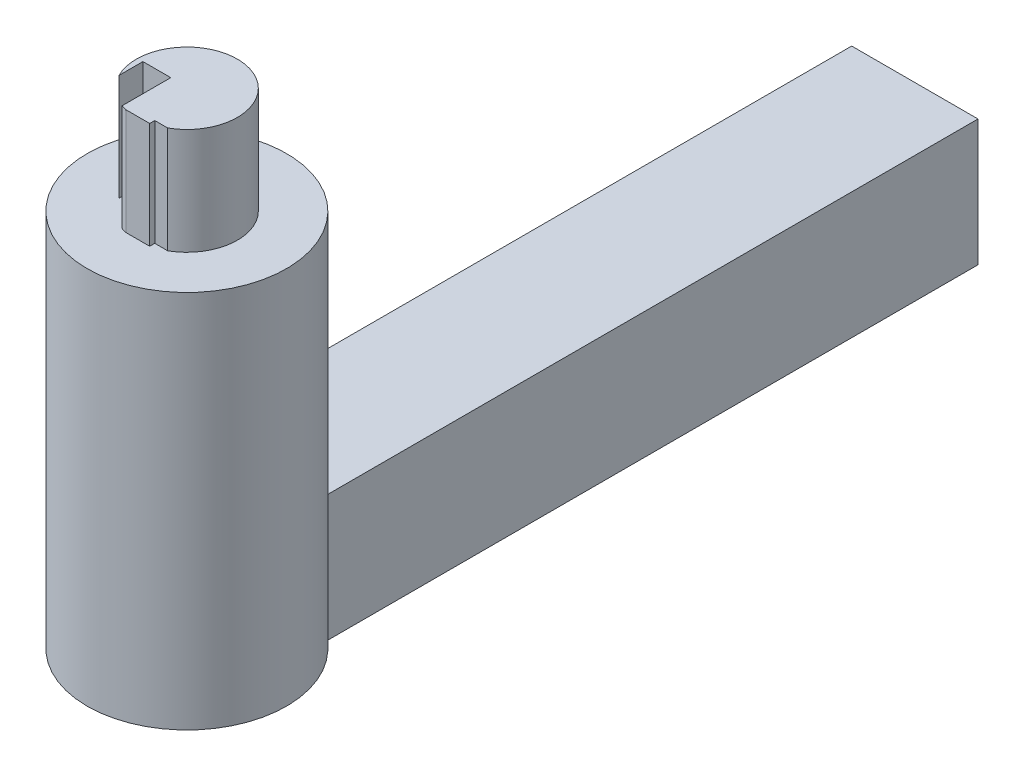
ISO-10303-21;
HEADER;
FILE_DESCRIPTION(('STEP AP214'),'2;1');
FILE_NAME('part.step','',(''),(''),'','','');
FILE_SCHEMA(('AUTOMOTIVE_DESIGN { 1 0 10303 214 1 1 1 1 }'));
ENDSEC;
DATA;
#1=APPLICATION_CONTEXT('core data for automotive mechanical design processes');
#2=APPLICATION_PROTOCOL_DEFINITION('international standard','automotive_design',2000,#1);
#3=PRODUCT_CONTEXT('',#1,'mechanical');
#4=PRODUCT('Part','Part','',(#3));
#5=PRODUCT_RELATED_PRODUCT_CATEGORY('part','',(#4));
#6=PRODUCT_DEFINITION_FORMATION('','',#4);
#7=PRODUCT_DEFINITION_CONTEXT('part definition',#1,'design');
#8=PRODUCT_DEFINITION('design','',#6,#7);
#9=PRODUCT_DEFINITION_SHAPE('','',#8);
#10=(LENGTH_UNIT() NAMED_UNIT(*) SI_UNIT(.MILLI.,.METRE.));
#11=(NAMED_UNIT(*) PLANE_ANGLE_UNIT() SI_UNIT($,.RADIAN.));
#12=(NAMED_UNIT(*) SI_UNIT($,.STERADIAN.) SOLID_ANGLE_UNIT());
#13=UNCERTAINTY_MEASURE_WITH_UNIT(LENGTH_MEASURE(1.E-05),#10,'distance_accuracy_value','');
#14=(GEOMETRIC_REPRESENTATION_CONTEXT(3) GLOBAL_UNCERTAINTY_ASSIGNED_CONTEXT((#13)) GLOBAL_UNIT_ASSIGNED_CONTEXT((#10,
#11,#12)) REPRESENTATION_CONTEXT('',''));
#15=CARTESIAN_POINT('',(0.,0.,0.));
#16=DIRECTION('',(0.,0.,1.));
#17=DIRECTION('',(1.,0.,0.));
#18=AXIS2_PLACEMENT_3D('',#15,#16,#17);
#19=CARTESIAN_POINT('',(4.75,9.5,-27.375));
#20=DIRECTION('',(-1.,0.,0.));
#21=DIRECTION('',(0.,0.,1.));
#22=AXIS2_PLACEMENT_3D('',#19,#20,#21);
#23=PLANE('',#22);
#24=DIRECTION('',(0.,0.,-1.));
#25=VECTOR('',#24,1.);
#26=CARTESIAN_POINT('',(4.75,9.5,-27.375));
#27=LINE('',#26,#25);
#28=CARTESIAN_POINT('',(4.75,9.5,21.5709066168781));
#29=VERTEX_POINT('',#28);
#30=CARTESIAN_POINT('',(4.75,9.5,-27.375));
#31=VERTEX_POINT('',#30);
#32=EDGE_CURVE('E179',#29,#31,#27,.T.);
#33=ORIENTED_EDGE('',*,*,#32,.F.);
#34=DIRECTION('',(0.,1.,0.));
#35=VECTOR('',#34,1.);
#36=CARTESIAN_POINT('',(4.75,-21.2132034355964,21.5709066168781));
#37=LINE('',#36,#35);
#38=CARTESIAN_POINT('',(4.75,0.,21.5709066168781));
#39=VERTEX_POINT('',#38);
#40=EDGE_CURVE('E175',#29,#39,#37,.F.);
#41=ORIENTED_EDGE('',*,*,#40,.T.);
#42=DIRECTION('',(0.,0.,-1.));
#43=VECTOR('',#42,1.);
#44=CARTESIAN_POINT('',(4.75,0.,-27.375));
#45=LINE('',#44,#43);
#46=CARTESIAN_POINT('',(4.75,0.,-27.375));
#47=VERTEX_POINT('',#46);
#48=EDGE_CURVE('E178',#39,#47,#45,.T.);
#49=ORIENTED_EDGE('',*,*,#48,.T.);
#50=DIRECTION('',(0.,-1.,0.));
#51=VECTOR('',#50,1.);
#52=CARTESIAN_POINT('',(4.75,9.5,-27.375));
#53=LINE('',#52,#51);
#54=EDGE_CURVE('E11',#31,#47,#53,.T.);
#55=ORIENTED_EDGE('',*,*,#54,.F.);
#56=EDGE_LOOP('',(#33,#41,#49,#55));
#57=FACE_BOUND('',#56,.T.);
#58=ADVANCED_FACE('F41',(#57),#23,.F.);
#59=CARTESIAN_POINT('',(-4.75,9.5,-27.375));
#60=DIRECTION('',(0.,0.,1.));
#61=DIRECTION('',(1.,0.,0.));
#62=AXIS2_PLACEMENT_3D('',#59,#60,#61);
#63=PLANE('',#62);
#64=DIRECTION('',(-1.,0.,0.));
#65=VECTOR('',#64,1.);
#66=CARTESIAN_POINT('',(-4.75,0.,-27.375));
#67=LINE('',#66,#65);
#68=CARTESIAN_POINT('',(-4.75,0.,-27.375));
#69=VERTEX_POINT('',#68);
#70=EDGE_CURVE('E191',#47,#69,#67,.T.);
#71=ORIENTED_EDGE('',*,*,#70,.T.);
#72=DIRECTION('',(0.,-1.,0.));
#73=VECTOR('',#72,1.);
#74=CARTESIAN_POINT('',(-4.75,9.5,-27.375));
#75=LINE('',#74,#73);
#76=CARTESIAN_POINT('',(-4.75,9.5,-27.375));
#77=VERTEX_POINT('',#76);
#78=EDGE_CURVE('E49',#77,#69,#75,.T.);
#79=ORIENTED_EDGE('',*,*,#78,.F.);
#80=DIRECTION('',(-1.,0.,0.));
#81=VECTOR('',#80,1.);
#82=CARTESIAN_POINT('',(-4.75,9.5,-27.375));
#83=LINE('',#82,#81);
#84=EDGE_CURVE('E182',#31,#77,#83,.T.);
#85=ORIENTED_EDGE('',*,*,#84,.F.);
#86=ORIENTED_EDGE('',*,*,#54,.T.);
#87=EDGE_LOOP('',(#71,#79,#85,#86));
#88=FACE_BOUND('',#87,.T.);
#89=ADVANCED_FACE('F218',(#88),#63,.F.);
#90=CARTESIAN_POINT('',(-4.75,9.5,-27.375));
#91=DIRECTION('',(1.,0.,0.));
#92=DIRECTION('',(0.,0.,-1.));
#93=AXIS2_PLACEMENT_3D('',#90,#91,#92);
#94=PLANE('',#93);
#95=DIRECTION('',(0.,0.,1.));
#96=VECTOR('',#95,1.);
#97=CARTESIAN_POINT('',(-4.75,0.,-27.375));
#98=LINE('',#97,#96);
#99=CARTESIAN_POINT('',(-4.75,0.,21.5709066168781));
#100=VERTEX_POINT('',#99);
#101=EDGE_CURVE('E183',#69,#100,#98,.T.);
#102=ORIENTED_EDGE('',*,*,#101,.T.);
#103=DIRECTION('',(0.,1.,0.));
#104=VECTOR('',#103,1.);
#105=CARTESIAN_POINT('',(-4.75,-21.2132034355964,21.5709066168781));
#106=LINE('',#105,#104);
#107=CARTESIAN_POINT('',(-4.75,9.5,21.5709066168781));
#108=VERTEX_POINT('',#107);
#109=EDGE_CURVE('E171',#100,#108,#106,.T.);
#110=ORIENTED_EDGE('',*,*,#109,.T.);
#111=DIRECTION('',(0.,0.,1.));
#112=VECTOR('',#111,1.);
#113=CARTESIAN_POINT('',(-4.75,9.5,-27.375));
#114=LINE('',#113,#112);
#115=EDGE_CURVE('E186',#77,#108,#114,.T.);
#116=ORIENTED_EDGE('',*,*,#115,.F.);
#117=ORIENTED_EDGE('',*,*,#78,.T.);
#118=EDGE_LOOP('',(#102,#110,#116,#117));
#119=FACE_BOUND('',#118,.T.);
#120=ADVANCED_FACE('F201',(#119),#94,.F.);
#121=CARTESIAN_POINT('',(0.,9.5,0.));
#122=DIRECTION('',(0.,1.,0.));
#123=DIRECTION('',(0.,0.,1.));
#124=AXIS2_PLACEMENT_3D('',#121,#122,#123);
#125=PLANE('',#124);
#126=CARTESIAN_POINT('',(0.,9.5,27.375));
#127=DIRECTION('',(0.,1.,0.));
#128=DIRECTION('',(0.,0.,1.));
#129=AXIS2_PLACEMENT_3D('',#126,#127,#128);
#130=CIRCLE('',#129,7.5);
#131=EDGE_CURVE('E167',#29,#108,#130,.T.);
#132=ORIENTED_EDGE('',*,*,#131,.F.);
#133=ORIENTED_EDGE('',*,*,#32,.T.);
#134=ORIENTED_EDGE('',*,*,#84,.T.);
#135=ORIENTED_EDGE('',*,*,#115,.T.);
#136=EDGE_LOOP('',(#132,#133,#134,#135));
#137=FACE_BOUND('',#136,.T.);
#138=ADVANCED_FACE('F215',(#137),#125,.T.);
#139=CARTESIAN_POINT('',(0.,0.,0.));
#140=DIRECTION('',(0.,1.,0.));
#141=DIRECTION('',(0.,0.,1.));
#142=AXIS2_PLACEMENT_3D('',#139,#140,#141);
#143=PLANE('',#142);
#144=ORIENTED_EDGE('',*,*,#48,.F.);
#145=CARTESIAN_POINT('',(0.,0.,27.375));
#146=DIRECTION('',(0.,1.,0.));
#147=DIRECTION('',(0.,0.,1.));
#148=AXIS2_PLACEMENT_3D('',#145,#146,#147);
#149=CIRCLE('',#148,7.5);
#150=EDGE_CURVE('E158',#39,#100,#149,.F.);
#151=ORIENTED_EDGE('',*,*,#150,.T.);
#152=ORIENTED_EDGE('',*,*,#101,.F.);
#153=ORIENTED_EDGE('',*,*,#70,.F.);
#154=EDGE_LOOP('',(#144,#151,#152,#153));
#155=FACE_BOUND('',#154,.T.);
#156=ADVANCED_FACE('F208',(#155),#143,.F.);
#157=CARTESIAN_POINT('',(0.,-21.2132034355964,27.375));
#158=DIRECTION('',(0.,1.,0.));
#159=DIRECTION('',(0.,0.,1.));
#160=AXIS2_PLACEMENT_3D('',#157,#158,#159);
#161=CYLINDRICAL_SURFACE('',#160,7.5);
#162=CARTESIAN_POINT('',(0.,28.5,27.375));
#163=DIRECTION('',(0.,1.,0.));
#164=DIRECTION('',(0.,0.,1.));
#165=AXIS2_PLACEMENT_3D('',#162,#163,#164);
#166=CIRCLE('',#165,7.5);
#167=CARTESIAN_POINT('',(0.,28.5,34.875));
#168=VERTEX_POINT('',#167);
#169=EDGE_CURVE('E153',#168,#168,#166,.T.);
#170=ORIENTED_EDGE('',*,*,#169,.F.);
#171=EDGE_LOOP('',(#170));
#172=FACE_BOUND('',#171,.T.);
#173=ORIENTED_EDGE('',*,*,#40,.F.);
#174=ORIENTED_EDGE('',*,*,#131,.T.);
#175=ORIENTED_EDGE('',*,*,#109,.F.);
#176=ORIENTED_EDGE('',*,*,#150,.F.);
#177=EDGE_LOOP('',(#173,#174,#175,#176));
#178=FACE_BOUND('',#177,.T.);
#179=ADVANCED_FACE('F212',(#172,#178),#161,.T.);
#180=CARTESIAN_POINT('',(0.,28.5,27.375));
#181=DIRECTION('',(0.,1.,0.));
#182=DIRECTION('',(0.,0.,1.));
#183=AXIS2_PLACEMENT_3D('',#180,#181,#182);
#184=PLANE('',#183);
#185=CARTESIAN_POINT('',(0.,28.5,27.375));
#186=DIRECTION('',(0.,1.,0.));
#187=DIRECTION('',(0.,0.,1.));
#188=AXIS2_PLACEMENT_3D('',#185,#186,#187);
#189=CIRCLE('',#188,3.8);
#190=CARTESIAN_POINT('',(-1.29624150996569,28.5,30.94708033894));
#191=VERTEX_POINT('',#190);
#192=CARTESIAN_POINT('',(-0.905889425871463,28.5,31.0654422970823));
#193=VERTEX_POINT('',#192);
#194=EDGE_CURVE('E56',#191,#193,#189,.T.);
#195=ORIENTED_EDGE('',*,*,#194,.F.);
#196=DIRECTION('',(0.,0.,1.));
#197=VECTOR('',#196,1.);
#198=CARTESIAN_POINT('',(-1.29624150996569,28.5,30.94708033894));
#199=LINE('',#198,#197);
#200=CARTESIAN_POINT('',(-1.29624150996569,28.5,27.2894334293422));
#201=VERTEX_POINT('',#200);
#202=EDGE_CURVE('E60',#201,#191,#199,.T.);
#203=ORIENTED_EDGE('',*,*,#202,.F.);
#204=DIRECTION('',(1.,0.,0.));
#205=VECTOR('',#204,1.);
#206=CARTESIAN_POINT('',(-1.29624150996569,28.5,27.2894334293422));
#207=LINE('',#206,#205);
#208=CARTESIAN_POINT('',(-3.391270855646,28.5,27.2894334293422));
#209=VERTEX_POINT('',#208);
#210=EDGE_CURVE('E369',#209,#201,#207,.T.);
#211=ORIENTED_EDGE('',*,*,#210,.F.);
#212=DIRECTION('',(0.,0.,-1.));
#213=VECTOR('',#212,1.);
#214=CARTESIAN_POINT('',(-3.391270855646,28.5,29.0894334293422));
#215=LINE('',#214,#213);
#216=CARTESIAN_POINT('',(-3.391270855646,28.5,29.0894334293422));
#217=VERTEX_POINT('',#216);
#218=EDGE_CURVE('E414',#217,#209,#215,.T.);
#219=ORIENTED_EDGE('',*,*,#218,.F.);
#220=CARTESIAN_POINT('',(0.,28.5,27.375));
#221=DIRECTION('',(0.,1.,0.));
#222=DIRECTION('',(0.,0.,1.));
#223=AXIS2_PLACEMENT_3D('',#220,#221,#222);
#224=CIRCLE('',#223,3.8);
#225=CARTESIAN_POINT('',(1.86802767047801,28.5,30.6841498337683));
#226=VERTEX_POINT('',#225);
#227=EDGE_CURVE('E406',#226,#217,#224,.T.);
#228=ORIENTED_EDGE('',*,*,#227,.F.);
#229=DIRECTION('',(1.,0.,0.));
#230=VECTOR('',#229,1.);
#231=CARTESIAN_POINT('',(1.86802767047801,28.5,30.6841498337683));
#232=LINE('',#231,#230);
#233=CARTESIAN_POINT('',(0.894110574128536,28.5,30.6841498337683));
#234=VERTEX_POINT('',#233);
#235=EDGE_CURVE('E397',#234,#226,#232,.T.);
#236=ORIENTED_EDGE('',*,*,#235,.F.);
#237=DIRECTION('',(0.,0.,-1.));
#238=VECTOR('',#237,1.);
#239=CARTESIAN_POINT('',(0.894110574128536,28.5,30.6841498337683));
#240=LINE('',#239,#238);
#241=CARTESIAN_POINT('',(0.894110574128536,28.5,31.0654422970823));
#242=VERTEX_POINT('',#241);
#243=EDGE_CURVE('E400',#242,#234,#240,.T.);
#244=ORIENTED_EDGE('',*,*,#243,.F.);
#245=DIRECTION('',(1.,0.,0.));
#246=VECTOR('',#245,1.);
#247=CARTESIAN_POINT('',(-0.905889425871463,28.5,31.0654422970823));
#248=LINE('',#247,#246);
#249=EDGE_CURVE('E402',#193,#242,#248,.T.);
#250=ORIENTED_EDGE('',*,*,#249,.F.);
#251=EDGE_LOOP('',(#195,#203,#211,#219,#228,#236,#244,#250));
#252=FACE_BOUND('',#251,.T.);
#253=ORIENTED_EDGE('',*,*,#169,.T.);
#254=EDGE_LOOP('',(#253));
#255=FACE_BOUND('',#254,.T.);
#256=ADVANCED_FACE('F232',(#252,#255),#184,.T.);
#257=CARTESIAN_POINT('',(0.,36.5,27.375));
#258=DIRECTION('',(0.,-1.,0.));
#259=DIRECTION('',(0.,0.,-1.));
#260=AXIS2_PLACEMENT_3D('',#257,#258,#259);
#261=CYLINDRICAL_SURFACE('',#260,3.8);
#262=ORIENTED_EDGE('',*,*,#194,.T.);
#263=DIRECTION('',(0.,-1.,0.));
#264=VECTOR('',#263,1.);
#265=CARTESIAN_POINT('',(-0.905889425871463,36.5,31.0654422970823));
#266=LINE('',#265,#264);
#267=CARTESIAN_POINT('',(-0.905889425871463,36.5,31.0654422970823));
#268=VERTEX_POINT('',#267);
#269=EDGE_CURVE('E133',#268,#193,#266,.T.);
#270=ORIENTED_EDGE('',*,*,#269,.F.);
#271=CARTESIAN_POINT('',(0.,36.5,27.375));
#272=DIRECTION('',(0.,1.,0.));
#273=DIRECTION('',(0.,0.,1.));
#274=AXIS2_PLACEMENT_3D('',#271,#272,#273);
#275=CIRCLE('',#274,3.8);
#276=CARTESIAN_POINT('',(-1.29624150996569,36.5,30.94708033894));
#277=VERTEX_POINT('',#276);
#278=EDGE_CURVE('E140',#277,#268,#275,.T.);
#279=ORIENTED_EDGE('',*,*,#278,.F.);
#280=DIRECTION('',(0.,-1.,0.));
#281=VECTOR('',#280,1.);
#282=CARTESIAN_POINT('',(-1.29624150996569,36.5,30.94708033894));
#283=LINE('',#282,#281);
#284=EDGE_CURVE('E365',#277,#191,#283,.T.);
#285=ORIENTED_EDGE('',*,*,#284,.T.);
#286=EDGE_LOOP('',(#262,#270,#279,#285));
#287=FACE_BOUND('',#286,.T.);
#288=ADVANCED_FACE('F151',(#287),#261,.T.);
#289=CARTESIAN_POINT('',(-0.905889425871463,36.5,31.0654422970823));
#290=DIRECTION('',(0.,0.,-1.));
#291=DIRECTION('',(-1.,0.,0.));
#292=AXIS2_PLACEMENT_3D('',#289,#290,#291);
#293=PLANE('',#292);
#294=ORIENTED_EDGE('',*,*,#249,.T.);
#295=DIRECTION('',(0.,-1.,0.));
#296=VECTOR('',#295,1.);
#297=CARTESIAN_POINT('',(0.894110574128536,36.5,31.0654422970823));
#298=LINE('',#297,#296);
#299=CARTESIAN_POINT('',(0.894110574128536,36.5,31.0654422970823));
#300=VERTEX_POINT('',#299);
#301=EDGE_CURVE('E135',#300,#242,#298,.T.);
#302=ORIENTED_EDGE('',*,*,#301,.F.);
#303=DIRECTION('',(1.,0.,0.));
#304=VECTOR('',#303,1.);
#305=CARTESIAN_POINT('',(-0.905889425871463,36.5,31.0654422970823));
#306=LINE('',#305,#304);
#307=EDGE_CURVE('E128',#268,#300,#306,.T.);
#308=ORIENTED_EDGE('',*,*,#307,.F.);
#309=ORIENTED_EDGE('',*,*,#269,.T.);
#310=EDGE_LOOP('',(#294,#302,#308,#309));
#311=FACE_BOUND('',#310,.T.);
#312=ADVANCED_FACE('F131',(#311),#293,.F.);
#313=CARTESIAN_POINT('',(0.894110574128536,36.5,30.6841498337683));
#314=DIRECTION('',(-1.,0.,0.));
#315=DIRECTION('',(0.,0.,1.));
#316=AXIS2_PLACEMENT_3D('',#313,#314,#315);
#317=PLANE('',#316);
#318=ORIENTED_EDGE('',*,*,#243,.T.);
#319=DIRECTION('',(0.,-1.,0.));
#320=VECTOR('',#319,1.);
#321=CARTESIAN_POINT('',(0.894110574128536,36.5,30.6841498337683));
#322=LINE('',#321,#320);
#323=CARTESIAN_POINT('',(0.894110574128536,36.5,30.6841498337683));
#324=VERTEX_POINT('',#323);
#325=EDGE_CURVE('E160',#324,#234,#322,.T.);
#326=ORIENTED_EDGE('',*,*,#325,.F.);
#327=DIRECTION('',(0.,0.,-1.));
#328=VECTOR('',#327,1.);
#329=CARTESIAN_POINT('',(0.894110574128536,36.5,30.6841498337683));
#330=LINE('',#329,#328);
#331=EDGE_CURVE('E139',#300,#324,#330,.T.);
#332=ORIENTED_EDGE('',*,*,#331,.F.);
#333=ORIENTED_EDGE('',*,*,#301,.T.);
#334=EDGE_LOOP('',(#318,#326,#332,#333));
#335=FACE_BOUND('',#334,.T.);
#336=ADVANCED_FACE('F240',(#335),#317,.F.);
#337=CARTESIAN_POINT('',(1.86802767047801,36.5,30.6841498337683));
#338=DIRECTION('',(0.,0.,-1.));
#339=DIRECTION('',(-1.,0.,0.));
#340=AXIS2_PLACEMENT_3D('',#337,#338,#339);
#341=PLANE('',#340);
#342=ORIENTED_EDGE('',*,*,#235,.T.);
#343=DIRECTION('',(0.,-1.,0.));
#344=VECTOR('',#343,1.);
#345=CARTESIAN_POINT('',(1.86802767047801,36.5,30.6841498337683));
#346=LINE('',#345,#344);
#347=CARTESIAN_POINT('',(1.86802767047801,36.5,30.6841498337683));
#348=VERTEX_POINT('',#347);
#349=EDGE_CURVE('E388',#348,#226,#346,.T.);
#350=ORIENTED_EDGE('',*,*,#349,.F.);
#351=DIRECTION('',(1.,0.,0.));
#352=VECTOR('',#351,1.);
#353=CARTESIAN_POINT('',(1.86802767047801,36.5,30.6841498337683));
#354=LINE('',#353,#352);
#355=EDGE_CURVE('E398',#324,#348,#354,.T.);
#356=ORIENTED_EDGE('',*,*,#355,.F.);
#357=ORIENTED_EDGE('',*,*,#325,.T.);
#358=EDGE_LOOP('',(#342,#350,#356,#357));
#359=FACE_BOUND('',#358,.T.);
#360=ADVANCED_FACE('F243',(#359),#341,.F.);
#361=CARTESIAN_POINT('',(0.,36.5,27.375));
#362=DIRECTION('',(0.,-1.,0.));
#363=DIRECTION('',(0.,0.,-1.));
#364=AXIS2_PLACEMENT_3D('',#361,#362,#363);
#365=CYLINDRICAL_SURFACE('',#364,3.8);
#366=ORIENTED_EDGE('',*,*,#227,.T.);
#367=DIRECTION('',(0.,-1.,0.));
#368=VECTOR('',#367,1.);
#369=CARTESIAN_POINT('',(-3.391270855646,36.5,29.0894334293422));
#370=LINE('',#369,#368);
#371=CARTESIAN_POINT('',(-3.391270855646,36.5,29.0894334293422));
#372=VERTEX_POINT('',#371);
#373=EDGE_CURVE('E384',#372,#217,#370,.T.);
#374=ORIENTED_EDGE('',*,*,#373,.F.);
#375=CARTESIAN_POINT('',(0.,36.5,27.375));
#376=DIRECTION('',(0.,1.,0.));
#377=DIRECTION('',(0.,0.,1.));
#378=AXIS2_PLACEMENT_3D('',#375,#376,#377);
#379=CIRCLE('',#378,3.8);
#380=EDGE_CURVE('E425',#348,#372,#379,.T.);
#381=ORIENTED_EDGE('',*,*,#380,.F.);
#382=ORIENTED_EDGE('',*,*,#349,.T.);
#383=EDGE_LOOP('',(#366,#374,#381,#382));
#384=FACE_BOUND('',#383,.T.);
#385=ADVANCED_FACE('F247',(#384),#365,.T.);
#386=CARTESIAN_POINT('',(-3.391270855646,36.5,29.0894334293422));
#387=DIRECTION('',(-1.,0.,0.));
#388=DIRECTION('',(0.,0.,1.));
#389=AXIS2_PLACEMENT_3D('',#386,#387,#388);
#390=PLANE('',#389);
#391=ORIENTED_EDGE('',*,*,#218,.T.);
#392=DIRECTION('',(0.,-1.,0.));
#393=VECTOR('',#392,1.);
#394=CARTESIAN_POINT('',(-3.391270855646,36.5,27.2894334293422));
#395=LINE('',#394,#393);
#396=CARTESIAN_POINT('',(-3.391270855646,36.5,27.2894334293422));
#397=VERTEX_POINT('',#396);
#398=EDGE_CURVE('E375',#397,#209,#395,.T.);
#399=ORIENTED_EDGE('',*,*,#398,.F.);
#400=DIRECTION('',(0.,0.,-1.));
#401=VECTOR('',#400,1.);
#402=CARTESIAN_POINT('',(-3.391270855646,36.5,29.0894334293422));
#403=LINE('',#402,#401);
#404=EDGE_CURVE('E423',#372,#397,#403,.T.);
#405=ORIENTED_EDGE('',*,*,#404,.F.);
#406=ORIENTED_EDGE('',*,*,#373,.T.);
#407=EDGE_LOOP('',(#391,#399,#405,#406));
#408=FACE_BOUND('',#407,.T.);
#409=ADVANCED_FACE('F251',(#408),#390,.F.);
#410=CARTESIAN_POINT('',(-1.29624150996569,36.5,27.2894334293422));
#411=DIRECTION('',(0.,0.,-1.));
#412=DIRECTION('',(-1.,0.,0.));
#413=AXIS2_PLACEMENT_3D('',#410,#411,#412);
#414=PLANE('',#413);
#415=ORIENTED_EDGE('',*,*,#210,.T.);
#416=DIRECTION('',(0.,-1.,0.));
#417=VECTOR('',#416,1.);
#418=CARTESIAN_POINT('',(-1.29624150996569,36.5,27.2894334293422));
#419=LINE('',#418,#417);
#420=CARTESIAN_POINT('',(-1.29624150996569,36.5,27.2894334293422));
#421=VERTEX_POINT('',#420);
#422=EDGE_CURVE('E367',#421,#201,#419,.T.);
#423=ORIENTED_EDGE('',*,*,#422,.F.);
#424=DIRECTION('',(1.,0.,0.));
#425=VECTOR('',#424,1.);
#426=CARTESIAN_POINT('',(-1.29624150996569,36.5,27.2894334293422));
#427=LINE('',#426,#425);
#428=EDGE_CURVE('E377',#397,#421,#427,.T.);
#429=ORIENTED_EDGE('',*,*,#428,.F.);
#430=ORIENTED_EDGE('',*,*,#398,.T.);
#431=EDGE_LOOP('',(#415,#423,#429,#430));
#432=FACE_BOUND('',#431,.T.);
#433=ADVANCED_FACE('F255',(#432),#414,.F.);
#434=CARTESIAN_POINT('',(-1.29624150996569,36.5,30.94708033894));
#435=DIRECTION('',(1.,0.,0.));
#436=DIRECTION('',(0.,0.,-1.));
#437=AXIS2_PLACEMENT_3D('',#434,#435,#436);
#438=PLANE('',#437);
#439=ORIENTED_EDGE('',*,*,#202,.T.);
#440=ORIENTED_EDGE('',*,*,#284,.F.);
#441=DIRECTION('',(0.,0.,1.));
#442=VECTOR('',#441,1.);
#443=CARTESIAN_POINT('',(-1.29624150996569,36.5,30.94708033894));
#444=LINE('',#443,#442);
#445=EDGE_CURVE('E145',#421,#277,#444,.T.);
#446=ORIENTED_EDGE('',*,*,#445,.F.);
#447=ORIENTED_EDGE('',*,*,#422,.T.);
#448=EDGE_LOOP('',(#439,#440,#446,#447));
#449=FACE_BOUND('',#448,.T.);
#450=ADVANCED_FACE('F259',(#449),#438,.F.);
#451=CARTESIAN_POINT('',(0.,36.5,27.375));
#452=DIRECTION('',(0.,1.,0.));
#453=DIRECTION('',(0.,0.,1.));
#454=AXIS2_PLACEMENT_3D('',#451,#452,#453);
#455=PLANE('',#454);
#456=ORIENTED_EDGE('',*,*,#278,.T.);
#457=ORIENTED_EDGE('',*,*,#307,.T.);
#458=ORIENTED_EDGE('',*,*,#331,.T.);
#459=ORIENTED_EDGE('',*,*,#355,.T.);
#460=ORIENTED_EDGE('',*,*,#380,.T.);
#461=ORIENTED_EDGE('',*,*,#404,.T.);
#462=ORIENTED_EDGE('',*,*,#428,.T.);
#463=ORIENTED_EDGE('',*,*,#445,.T.);
#464=EDGE_LOOP('',(#456,#457,#458,#459,#460,#461,#462,#463));
#465=FACE_BOUND('',#464,.T.);
#466=ADVANCED_FACE('F143',(#465),#455,.T.);
#467=CLOSED_SHELL('',(#58,#89,#120,#138,#156,#179,#256,#288,#312,#336,#360,#385,#409,#433,#450,#466));
#468=MANIFOLD_SOLID_BREP('B2',#467);
#469=ADVANCED_BREP_SHAPE_REPRESENTATION('',(#18,#468),#14);
#470=SHAPE_DEFINITION_REPRESENTATION(#9,#469);
ENDSEC;
END-ISO-10303-21;
